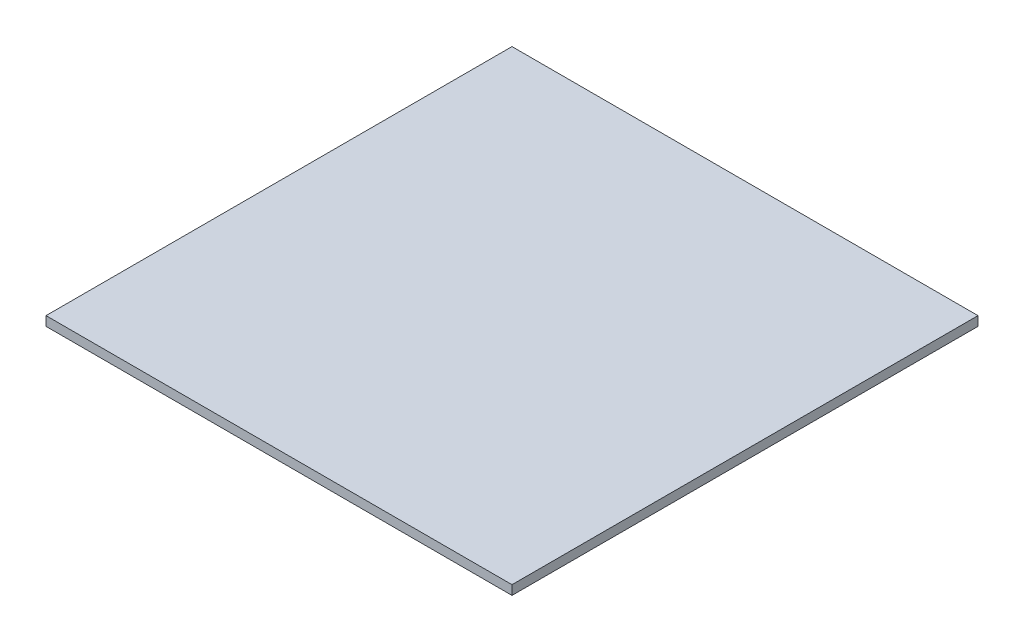
ISO-10303-21;
HEADER;
FILE_DESCRIPTION(('STEP AP214'),'2;1');
FILE_NAME('part.step','',(''),(''),'','','');
FILE_SCHEMA(('AUTOMOTIVE_DESIGN { 1 0 10303 214 1 1 1 1 }'));
ENDSEC;
DATA;
#1=APPLICATION_CONTEXT('core data for automotive mechanical design processes');
#2=APPLICATION_PROTOCOL_DEFINITION('international standard','automotive_design',2000,#1);
#3=PRODUCT_CONTEXT('',#1,'mechanical');
#4=PRODUCT('Part','Part','',(#3));
#5=PRODUCT_RELATED_PRODUCT_CATEGORY('part','',(#4));
#6=PRODUCT_DEFINITION_FORMATION('','',#4);
#7=PRODUCT_DEFINITION_CONTEXT('part definition',#1,'design');
#8=PRODUCT_DEFINITION('design','',#6,#7);
#9=PRODUCT_DEFINITION_SHAPE('','',#8);
#10=(LENGTH_UNIT() NAMED_UNIT(*) SI_UNIT(.MILLI.,.METRE.));
#11=(NAMED_UNIT(*) PLANE_ANGLE_UNIT() SI_UNIT($,.RADIAN.));
#12=(NAMED_UNIT(*) SI_UNIT($,.STERADIAN.) SOLID_ANGLE_UNIT());
#13=UNCERTAINTY_MEASURE_WITH_UNIT(LENGTH_MEASURE(1.E-05),#10,'distance_accuracy_value','');
#14=(GEOMETRIC_REPRESENTATION_CONTEXT(3) GLOBAL_UNCERTAINTY_ASSIGNED_CONTEXT((#13)) GLOBAL_UNIT_ASSIGNED_CONTEXT((#10,
#11,#12)) REPRESENTATION_CONTEXT('',''));
#15=CARTESIAN_POINT('',(0.,0.,0.));
#16=DIRECTION('',(0.,0.,1.));
#17=DIRECTION('',(1.,0.,0.));
#18=AXIS2_PLACEMENT_3D('',#15,#16,#17);
#19=CARTESIAN_POINT('',(0.,10.,0.));
#20=DIRECTION('',(1.,0.,0.));
#21=DIRECTION('',(0.,0.,-1.));
#22=AXIS2_PLACEMENT_3D('',#19,#20,#21);
#23=PLANE('',#22);
#24=DIRECTION('',(0.,0.,1.));
#25=VECTOR('',#24,1.);
#26=CARTESIAN_POINT('',(0.,0.,0.));
#27=LINE('',#26,#25);
#28=CARTESIAN_POINT('',(0.,0.,-500.));
#29=VERTEX_POINT('',#28);
#30=CARTESIAN_POINT('',(0.,0.,0.));
#31=VERTEX_POINT('',#30);
#32=EDGE_CURVE('E94',#29,#31,#27,.T.);
#33=ORIENTED_EDGE('',*,*,#32,.T.);
#34=DIRECTION('',(0.,-1.,0.));
#35=VECTOR('',#34,1.);
#36=CARTESIAN_POINT('',(0.,10.,0.));
#37=LINE('',#36,#35);
#38=CARTESIAN_POINT('',(0.,10.,0.));
#39=VERTEX_POINT('',#38);
#40=EDGE_CURVE('E11',#39,#31,#37,.T.);
#41=ORIENTED_EDGE('',*,*,#40,.F.);
#42=DIRECTION('',(0.,0.,1.));
#43=VECTOR('',#42,1.);
#44=CARTESIAN_POINT('',(0.,10.,0.));
#45=LINE('',#44,#43);
#46=CARTESIAN_POINT('',(0.,10.,-500.));
#47=VERTEX_POINT('',#46);
#48=EDGE_CURVE('E82',#47,#39,#45,.T.);
#49=ORIENTED_EDGE('',*,*,#48,.F.);
#50=DIRECTION('',(0.,-1.,0.));
#51=VECTOR('',#50,1.);
#52=CARTESIAN_POINT('',(0.,10.,-500.));
#53=LINE('',#52,#51);
#54=EDGE_CURVE('E90',#47,#29,#53,.T.);
#55=ORIENTED_EDGE('',*,*,#54,.T.);
#56=EDGE_LOOP('',(#33,#41,#49,#55));
#57=FACE_BOUND('',#56,.T.);
#58=ADVANCED_FACE('F31',(#57),#23,.F.);
#59=CARTESIAN_POINT('',(0.,10.,0.));
#60=DIRECTION('',(0.,0.,-1.));
#61=DIRECTION('',(-1.,0.,0.));
#62=AXIS2_PLACEMENT_3D('',#59,#60,#61);
#63=PLANE('',#62);
#64=DIRECTION('',(1.,0.,0.));
#65=VECTOR('',#64,1.);
#66=CARTESIAN_POINT('',(0.,0.,0.));
#67=LINE('',#66,#65);
#68=CARTESIAN_POINT('',(500.,0.,0.));
#69=VERTEX_POINT('',#68);
#70=EDGE_CURVE('E86',#31,#69,#67,.T.);
#71=ORIENTED_EDGE('',*,*,#70,.T.);
#72=DIRECTION('',(0.,-1.,0.));
#73=VECTOR('',#72,1.);
#74=CARTESIAN_POINT('',(500.,10.,0.));
#75=LINE('',#74,#73);
#76=CARTESIAN_POINT('',(500.,10.,0.));
#77=VERTEX_POINT('',#76);
#78=EDGE_CURVE('E39',#77,#69,#75,.T.);
#79=ORIENTED_EDGE('',*,*,#78,.F.);
#80=DIRECTION('',(1.,0.,0.));
#81=VECTOR('',#80,1.);
#82=CARTESIAN_POINT('',(0.,10.,0.));
#83=LINE('',#82,#81);
#84=EDGE_CURVE('E77',#39,#77,#83,.T.);
#85=ORIENTED_EDGE('',*,*,#84,.F.);
#86=ORIENTED_EDGE('',*,*,#40,.T.);
#87=EDGE_LOOP('',(#71,#79,#85,#86));
#88=FACE_BOUND('',#87,.T.);
#89=ADVANCED_FACE('F85',(#88),#63,.F.);
#90=CARTESIAN_POINT('',(500.,10.,0.));
#91=DIRECTION('',(-1.,0.,0.));
#92=DIRECTION('',(0.,0.,1.));
#93=AXIS2_PLACEMENT_3D('',#90,#91,#92);
#94=PLANE('',#93);
#95=DIRECTION('',(0.,0.,-1.));
#96=VECTOR('',#95,1.);
#97=CARTESIAN_POINT('',(500.,0.,0.));
#98=LINE('',#97,#96);
#99=CARTESIAN_POINT('',(500.,0.,-500.));
#100=VERTEX_POINT('',#99);
#101=EDGE_CURVE('E64',#69,#100,#98,.T.);
#102=ORIENTED_EDGE('',*,*,#101,.T.);
#103=DIRECTION('',(0.,-1.,0.));
#104=VECTOR('',#103,1.);
#105=CARTESIAN_POINT('',(500.,10.,-500.));
#106=LINE('',#105,#104);
#107=CARTESIAN_POINT('',(500.,10.,-500.));
#108=VERTEX_POINT('',#107);
#109=EDGE_CURVE('E87',#108,#100,#106,.T.);
#110=ORIENTED_EDGE('',*,*,#109,.F.);
#111=DIRECTION('',(0.,0.,-1.));
#112=VECTOR('',#111,1.);
#113=CARTESIAN_POINT('',(500.,10.,0.));
#114=LINE('',#113,#112);
#115=EDGE_CURVE('E80',#77,#108,#114,.T.);
#116=ORIENTED_EDGE('',*,*,#115,.F.);
#117=ORIENTED_EDGE('',*,*,#78,.T.);
#118=EDGE_LOOP('',(#102,#110,#116,#117));
#119=FACE_BOUND('',#118,.T.);
#120=ADVANCED_FACE('F88',(#119),#94,.F.);
#121=CARTESIAN_POINT('',(0.,10.,-500.));
#122=DIRECTION('',(0.,0.,1.));
#123=DIRECTION('',(1.,0.,0.));
#124=AXIS2_PLACEMENT_3D('',#121,#122,#123);
#125=PLANE('',#124);
#126=DIRECTION('',(-1.,0.,0.));
#127=VECTOR('',#126,1.);
#128=CARTESIAN_POINT('',(0.,0.,-500.));
#129=LINE('',#128,#127);
#130=EDGE_CURVE('E70',#100,#29,#129,.T.);
#131=ORIENTED_EDGE('',*,*,#130,.T.);
#132=ORIENTED_EDGE('',*,*,#54,.F.);
#133=DIRECTION('',(-1.,0.,0.));
#134=VECTOR('',#133,1.);
#135=CARTESIAN_POINT('',(0.,10.,-500.));
#136=LINE('',#135,#134);
#137=EDGE_CURVE('E47',#108,#47,#136,.T.);
#138=ORIENTED_EDGE('',*,*,#137,.F.);
#139=ORIENTED_EDGE('',*,*,#109,.T.);
#140=EDGE_LOOP('',(#131,#132,#138,#139));
#141=FACE_BOUND('',#140,.T.);
#142=ADVANCED_FACE('F101',(#141),#125,.F.);
#143=CARTESIAN_POINT('',(0.,10.,-500.));
#144=DIRECTION('',(0.,-1.,0.));
#145=DIRECTION('',(0.,0.,-1.));
#146=AXIS2_PLACEMENT_3D('',#143,#144,#145);
#147=PLANE('',#146);
#148=ORIENTED_EDGE('',*,*,#48,.T.);
#149=ORIENTED_EDGE('',*,*,#84,.T.);
#150=ORIENTED_EDGE('',*,*,#115,.T.);
#151=ORIENTED_EDGE('',*,*,#137,.T.);
#152=EDGE_LOOP('',(#148,#149,#150,#151));
#153=FACE_BOUND('',#152,.T.);
#154=ADVANCED_FACE('F78',(#153),#147,.F.);
#155=CARTESIAN_POINT('',(0.,0.,-500.));
#156=DIRECTION('',(0.,-1.,0.));
#157=DIRECTION('',(0.,0.,-1.));
#158=AXIS2_PLACEMENT_3D('',#155,#156,#157);
#159=PLANE('',#158);
#160=ORIENTED_EDGE('',*,*,#32,.F.);
#161=ORIENTED_EDGE('',*,*,#130,.F.);
#162=ORIENTED_EDGE('',*,*,#101,.F.);
#163=ORIENTED_EDGE('',*,*,#70,.F.);
#164=EDGE_LOOP('',(#160,#161,#162,#163));
#165=FACE_BOUND('',#164,.T.);
#166=ADVANCED_FACE('F104',(#165),#159,.T.);
#167=CLOSED_SHELL('',(#58,#89,#120,#142,#154,#166));
#168=MANIFOLD_SOLID_BREP('B2',#167);
#169=ADVANCED_BREP_SHAPE_REPRESENTATION('',(#18,#168),#14);
#170=SHAPE_DEFINITION_REPRESENTATION(#9,#169);
ENDSEC;
END-ISO-10303-21;
